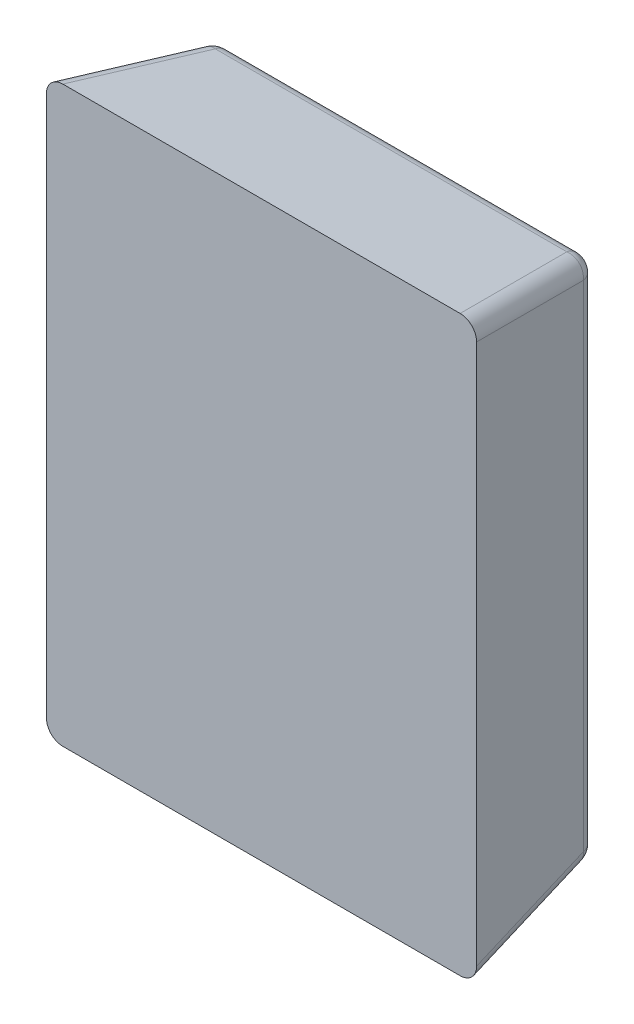
ISO-10303-21;
HEADER;
FILE_DESCRIPTION(('STEP AP214'),'2;1');
FILE_NAME('part.step','',(''),(''),'','','');
FILE_SCHEMA(('AUTOMOTIVE_DESIGN { 1 0 10303 214 1 1 1 1 }'));
ENDSEC;
DATA;
#1=APPLICATION_CONTEXT('core data for automotive mechanical design processes');
#2=APPLICATION_PROTOCOL_DEFINITION('international standard','automotive_design',2000,#1);
#3=PRODUCT_CONTEXT('',#1,'mechanical');
#4=PRODUCT('Part','Part','',(#3));
#5=PRODUCT_RELATED_PRODUCT_CATEGORY('part','',(#4));
#6=PRODUCT_DEFINITION_FORMATION('','',#4);
#7=PRODUCT_DEFINITION_CONTEXT('part definition',#1,'design');
#8=PRODUCT_DEFINITION('design','',#6,#7);
#9=PRODUCT_DEFINITION_SHAPE('','',#8);
#10=(LENGTH_UNIT() NAMED_UNIT(*) SI_UNIT(.MILLI.,.METRE.));
#11=(NAMED_UNIT(*) PLANE_ANGLE_UNIT() SI_UNIT($,.RADIAN.));
#12=(NAMED_UNIT(*) SI_UNIT($,.STERADIAN.) SOLID_ANGLE_UNIT());
#13=UNCERTAINTY_MEASURE_WITH_UNIT(LENGTH_MEASURE(1.E-05),#10,'distance_accuracy_value','');
#14=(GEOMETRIC_REPRESENTATION_CONTEXT(3) GLOBAL_UNCERTAINTY_ASSIGNED_CONTEXT((#13)) GLOBAL_UNIT_ASSIGNED_CONTEXT((#10,
#11,#12)) REPRESENTATION_CONTEXT('',''));
#15=CARTESIAN_POINT('',(0.,0.,0.));
#16=DIRECTION('',(0.,0.,1.));
#17=DIRECTION('',(1.,0.,0.));
#18=AXIS2_PLACEMENT_3D('',#15,#16,#17);
#19=CARTESIAN_POINT('',(1.12653571469062,-0.641019643054923,0.105));
#20=DIRECTION('',(0.,0.,-1.));
#21=DIRECTION('',(-1.,0.,0.));
#22=AXIS2_PLACEMENT_3D('',#19,#20,#21);
#23=PLANE('',#22);
#24=DIRECTION('',(0.,-1.,0.));
#25=VECTOR('',#24,1.);
#26=CARTESIAN_POINT('',(1.20008239842987,-0.701017157850477,0.105));
#27=LINE('',#26,#25);
#28=CARTESIAN_POINT('',(1.20008239842987,-0.744561356385283,0.105));
#29=VERTEX_POINT('',#28);
#30=CARTESIAN_POINT('',(1.20008239842987,-0.537477929724562,0.105));
#31=VERTEX_POINT('',#30);
#32=EDGE_CURVE('E236',#29,#31,#27,.F.);
#33=ORIENTED_EDGE('',*,*,#32,.F.);
#34=DIRECTION('',(-1.,0.,0.));
#35=VECTOR('',#34,1.);
#36=CARTESIAN_POINT('',(1.08153571469062,-0.744561356385283,0.105));
#37=LINE('',#36,#35);
#38=CARTESIAN_POINT('',(1.05298903095137,-0.744561356385283,0.105));
#39=VERTEX_POINT('',#38);
#40=EDGE_CURVE('E224',#39,#29,#37,.F.);
#41=ORIENTED_EDGE('',*,*,#40,.F.);
#42=DIRECTION('',(0.,1.,0.));
#43=VECTOR('',#42,1.);
#44=CARTESIAN_POINT('',(1.05298903095136,-0.581022128259368,0.105));
#45=LINE('',#44,#43);
#46=CARTESIAN_POINT('',(1.05298903095136,-0.537477929724562,0.105));
#47=VERTEX_POINT('',#46);
#48=EDGE_CURVE('E229',#47,#39,#45,.F.);
#49=ORIENTED_EDGE('',*,*,#48,.F.);
#50=DIRECTION('',(1.,0.,0.));
#51=VECTOR('',#50,1.);
#52=CARTESIAN_POINT('',(1.17153571469062,-0.537477929724562,0.105));
#53=LINE('',#52,#51);
#54=EDGE_CURVE('E241',#31,#47,#53,.F.);
#55=ORIENTED_EDGE('',*,*,#54,.F.);
#56=EDGE_LOOP('',(#33,#41,#49,#55));
#57=FACE_BOUND('',#56,.T.);
#58=ADVANCED_FACE('F17',(#57),#23,.T.);
#59=CARTESIAN_POINT('',(1.05298903095136,-0.581022128259368,0.112));
#60=DIRECTION('',(0.,1.,0.));
#61=DIRECTION('',(-1.,0.,0.));
#62=AXIS2_PLACEMENT_3D('',#59,#60,#61);
#63=CYLINDRICAL_SURFACE('',#62,0.007);
#64=DIRECTION('',(0.,1.,0.));
#65=VECTOR('',#64,1.);
#66=CARTESIAN_POINT('',(1.04609537668028,-0.521024613463813,0.110784462756332));
#67=LINE('',#66,#65);
#68=CARTESIAN_POINT('',(1.04609537668028,-0.537477929724562,0.110784462756332));
#69=VERTEX_POINT('',#68);
#70=CARTESIAN_POINT('',(1.04609537668028,-0.744561356385283,0.110784462756331));
#71=VERTEX_POINT('',#70);
#72=EDGE_CURVE('E114',#69,#71,#67,.F.);
#73=ORIENTED_EDGE('',*,*,#72,.F.);
#74=CARTESIAN_POINT('',(1.05298903095137,-0.537477929724562,0.112));
#75=DIRECTION('',(0.,1.,0.));
#76=DIRECTION('',(1.,0.,0.));
#77=AXIS2_PLACEMENT_3D('',#74,#75,#76);
#78=CIRCLE('',#77,0.007);
#79=EDGE_CURVE('E221',#47,#69,#78,.T.);
#80=ORIENTED_EDGE('',*,*,#79,.F.);
#81=ORIENTED_EDGE('',*,*,#48,.T.);
#82=CARTESIAN_POINT('',(1.05298903095137,-0.744561356385283,0.112));
#83=DIRECTION('',(0.,1.,0.));
#84=DIRECTION('',(1.,0.,0.));
#85=AXIS2_PLACEMENT_3D('',#82,#83,#84);
#86=CIRCLE('',#85,0.007);
#87=EDGE_CURVE('E74',#71,#39,#86,.F.);
#88=ORIENTED_EDGE('',*,*,#87,.F.);
#89=EDGE_LOOP('',(#73,#80,#81,#88));
#90=FACE_BOUND('',#89,.T.);
#91=ADVANCED_FACE('F214',(#90),#63,.T.);
#92=CARTESIAN_POINT('',(1.05298903095137,-0.537477929724562,0.112));
#93=DIRECTION('',(1.,0.,0.));
#94=DIRECTION('',(0.,1.,0.));
#95=AXIS2_PLACEMENT_3D('',#92,#93,#94);
#96=SPHERICAL_SURFACE('',#95,0.007);
#97=ORIENTED_EDGE('',*,*,#79,.T.);
#98=CARTESIAN_POINT('',(1.05298903095137,-0.537477929724562,0.111999999999999));
#99=DIRECTION('',(-0.17108786974604,0.171087869746041,0.970287525247812));
#100=DIRECTION('',(0.,-0.984807753012207,0.173648177666936));
#101=AXIS2_PLACEMENT_3D('',#98,#99,#100);
#102=CIRCLE('',#101,0.007);
#103=CARTESIAN_POINT('',(1.05298903095136,-0.530584275453477,0.11078446275633));
#104=VERTEX_POINT('',#103);
#105=EDGE_CURVE('E20',#104,#69,#102,.T.);
#106=ORIENTED_EDGE('',*,*,#105,.F.);
#107=CARTESIAN_POINT('',(1.05298903095136,-0.537477929724562,0.112));
#108=DIRECTION('',(1.,0.,0.));
#109=DIRECTION('',(0.,1.,0.));
#110=AXIS2_PLACEMENT_3D('',#107,#108,#109);
#111=CIRCLE('',#110,0.007);
#112=EDGE_CURVE('E223',#47,#104,#111,.T.);
#113=ORIENTED_EDGE('',*,*,#112,.F.);
#114=EDGE_LOOP('',(#97,#106,#113));
#115=FACE_BOUND('',#114,.T.);
#116=ADVANCED_FACE('F210',(#115),#96,.T.);
#117=CARTESIAN_POINT('',(1.17153571469062,-0.537477929724562,0.112));
#118=DIRECTION('',(1.,0.,0.));
#119=DIRECTION('',(0.,1.,0.));
#120=AXIS2_PLACEMENT_3D('',#117,#118,#119);
#121=CYLINDRICAL_SURFACE('',#120,0.007);
#122=DIRECTION('',(1.,0.,0.));
#123=VECTOR('',#122,1.);
#124=CARTESIAN_POINT('',(1.21653571469062,-0.530584275453476,0.110784462756331));
#125=LINE('',#124,#123);
#126=CARTESIAN_POINT('',(1.20008239842987,-0.530584275453476,0.110784462756331));
#127=VERTEX_POINT('',#126);
#128=EDGE_CURVE('E146',#127,#104,#125,.F.);
#129=ORIENTED_EDGE('',*,*,#128,.F.);
#130=CARTESIAN_POINT('',(1.20008239842987,-0.537477929724562,0.112));
#131=DIRECTION('',(1.,0.,0.));
#132=DIRECTION('',(0.,1.,0.));
#133=AXIS2_PLACEMENT_3D('',#130,#131,#132);
#134=CIRCLE('',#133,0.00699999999999995);
#135=EDGE_CURVE('E198',#31,#127,#134,.T.);
#136=ORIENTED_EDGE('',*,*,#135,.F.);
#137=ORIENTED_EDGE('',*,*,#54,.T.);
#138=ORIENTED_EDGE('',*,*,#112,.T.);
#139=EDGE_LOOP('',(#129,#136,#137,#138));
#140=FACE_BOUND('',#139,.T.);
#141=ADVANCED_FACE('F206',(#140),#121,.T.);
#142=CARTESIAN_POINT('',(1.20008239842987,-0.537477929724562,0.112));
#143=DIRECTION('',(1.,0.,0.));
#144=DIRECTION('',(0.,1.,0.));
#145=AXIS2_PLACEMENT_3D('',#142,#143,#144);
#146=SPHERICAL_SURFACE('',#145,0.007);
#147=ORIENTED_EDGE('',*,*,#135,.T.);
#148=CARTESIAN_POINT('',(1.20008239842987,-0.537477929724562,0.111999999999999));
#149=DIRECTION('',(0.171087869746028,0.171087869746031,0.970287525247816));
#150=DIRECTION('',(0.,-0.984807753012209,0.173648177666926));
#151=AXIS2_PLACEMENT_3D('',#148,#149,#150);
#152=CIRCLE('',#151,0.007);
#153=CARTESIAN_POINT('',(1.20697605270095,-0.537477929724562,0.11078446275633));
#154=VERTEX_POINT('',#153);
#155=EDGE_CURVE('E136',#154,#127,#152,.T.);
#156=ORIENTED_EDGE('',*,*,#155,.F.);
#157=CARTESIAN_POINT('',(1.20008239842987,-0.537477929724562,0.112));
#158=DIRECTION('',(0.,-1.,0.));
#159=DIRECTION('',(1.,0.,0.));
#160=AXIS2_PLACEMENT_3D('',#157,#158,#159);
#161=CIRCLE('',#160,0.007);
#162=EDGE_CURVE('E194',#31,#154,#161,.T.);
#163=ORIENTED_EDGE('',*,*,#162,.F.);
#164=EDGE_LOOP('',(#147,#156,#163));
#165=FACE_BOUND('',#164,.T.);
#166=ADVANCED_FACE('F203',(#165),#146,.T.);
#167=CARTESIAN_POINT('',(1.20008239842987,-0.701017157850477,0.112));
#168=DIRECTION('',(0.,-1.,0.));
#169=DIRECTION('',(1.,0.,0.));
#170=AXIS2_PLACEMENT_3D('',#167,#168,#169);
#171=CYLINDRICAL_SURFACE('',#170,0.007);
#172=DIRECTION('',(0.,1.,0.));
#173=VECTOR('',#172,1.);
#174=CARTESIAN_POINT('',(1.20697605270096,-0.761014672646032,0.11078446275633));
#175=LINE('',#174,#173);
#176=CARTESIAN_POINT('',(1.20697605270096,-0.744561356385283,0.11078446275633));
#177=VERTEX_POINT('',#176);
#178=EDGE_CURVE('E137',#177,#154,#175,.T.);
#179=ORIENTED_EDGE('',*,*,#178,.F.);
#180=CARTESIAN_POINT('',(1.20008239842987,-0.744561356385283,0.112));
#181=DIRECTION('',(0.,1.,0.));
#182=DIRECTION('',(1.,0.,0.));
#183=AXIS2_PLACEMENT_3D('',#180,#181,#182);
#184=CIRCLE('',#183,0.007);
#185=EDGE_CURVE('E190',#29,#177,#184,.F.);
#186=ORIENTED_EDGE('',*,*,#185,.F.);
#187=ORIENTED_EDGE('',*,*,#32,.T.);
#188=ORIENTED_EDGE('',*,*,#162,.T.);
#189=EDGE_LOOP('',(#179,#186,#187,#188));
#190=FACE_BOUND('',#189,.T.);
#191=ADVANCED_FACE('F182',(#190),#171,.T.);
#192=CARTESIAN_POINT('',(1.20008239842987,-0.744561356385283,0.112));
#193=DIRECTION('',(1.,0.,0.));
#194=DIRECTION('',(0.,1.,0.));
#195=AXIS2_PLACEMENT_3D('',#192,#193,#194);
#196=SPHERICAL_SURFACE('',#195,0.007);
#197=CARTESIAN_POINT('',(1.20008239842987,-0.744561356385283,0.112));
#198=DIRECTION('',(-1.,0.,0.));
#199=DIRECTION('',(0.,-1.,0.));
#200=AXIS2_PLACEMENT_3D('',#197,#198,#199);
#201=CIRCLE('',#200,0.007);
#202=CARTESIAN_POINT('',(1.20008239842987,-0.751455010656368,0.110784462756331));
#203=VERTEX_POINT('',#202);
#204=EDGE_CURVE('E193',#29,#203,#201,.T.);
#205=ORIENTED_EDGE('',*,*,#204,.F.);
#206=ORIENTED_EDGE('',*,*,#185,.T.);
#207=CARTESIAN_POINT('',(1.20008239842987,-0.744561356385283,0.111999999999999));
#208=DIRECTION('',(0.171087869746032,-0.171087869746034,0.970287525247815));
#209=DIRECTION('',(0.,-0.984807753012208,-0.173648177666929));
#210=AXIS2_PLACEMENT_3D('',#207,#208,#209);
#211=CIRCLE('',#210,0.007);
#212=EDGE_CURVE('E133',#203,#177,#211,.T.);
#213=ORIENTED_EDGE('',*,*,#212,.F.);
#214=EDGE_LOOP('',(#205,#206,#213));
#215=FACE_BOUND('',#214,.T.);
#216=ADVANCED_FACE('F178',(#215),#196,.T.);
#217=CARTESIAN_POINT('',(1.08153571469062,-0.744561356385283,0.112));
#218=DIRECTION('',(-1.,0.,0.));
#219=DIRECTION('',(0.,-1.,0.));
#220=AXIS2_PLACEMENT_3D('',#217,#218,#219);
#221=CYLINDRICAL_SURFACE('',#220,0.007);
#222=DIRECTION('',(1.,0.,0.));
#223=VECTOR('',#222,1.);
#224=CARTESIAN_POINT('',(1.03653571469062,-0.751455010656368,0.110784462756331));
#225=LINE('',#224,#223);
#226=CARTESIAN_POINT('',(1.05298903095137,-0.751455010656369,0.110784462756332));
#227=VERTEX_POINT('',#226);
#228=EDGE_CURVE('E134',#227,#203,#225,.T.);
#229=ORIENTED_EDGE('',*,*,#228,.F.);
#230=CARTESIAN_POINT('',(1.05298903095137,-0.744561356385283,0.112));
#231=DIRECTION('',(1.,0.,0.));
#232=DIRECTION('',(0.,1.,0.));
#233=AXIS2_PLACEMENT_3D('',#230,#231,#232);
#234=CIRCLE('',#233,0.00699999999999995);
#235=EDGE_CURVE('E82',#39,#227,#234,.F.);
#236=ORIENTED_EDGE('',*,*,#235,.F.);
#237=ORIENTED_EDGE('',*,*,#40,.T.);
#238=ORIENTED_EDGE('',*,*,#204,.T.);
#239=EDGE_LOOP('',(#229,#236,#237,#238));
#240=FACE_BOUND('',#239,.T.);
#241=ADVANCED_FACE('F173',(#240),#221,.T.);
#242=CARTESIAN_POINT('',(1.05298903095137,-0.744561356385283,0.112));
#243=DIRECTION('',(1.,0.,0.));
#244=DIRECTION('',(0.,1.,0.));
#245=AXIS2_PLACEMENT_3D('',#242,#243,#244);
#246=SPHERICAL_SURFACE('',#245,0.007);
#247=ORIENTED_EDGE('',*,*,#87,.T.);
#248=ORIENTED_EDGE('',*,*,#235,.T.);
#249=CARTESIAN_POINT('',(1.05298903095136,-0.744561356385283,0.112));
#250=DIRECTION('',(-0.171087869746039,-0.171087869746042,0.970287525247812));
#251=DIRECTION('',(0.,-0.984807753012207,-0.173648177666937));
#252=AXIS2_PLACEMENT_3D('',#249,#250,#251);
#253=CIRCLE('',#252,0.007);
#254=EDGE_CURVE('E126',#71,#227,#253,.T.);
#255=ORIENTED_EDGE('',*,*,#254,.F.);
#256=EDGE_LOOP('',(#247,#248,#255));
#257=FACE_BOUND('',#256,.T.);
#258=ADVANCED_FACE('F169',(#257),#246,.T.);
#259=CARTESIAN_POINT('',(1.03653571469062,-0.521024613463813,0.165));
#260=DIRECTION('',(-0.984807753012208,0.,-0.173648177666929));
#261=DIRECTION('',(-0.173648177666929,0.,0.984807753012208));
#262=AXIS2_PLACEMENT_3D('',#259,#260,#261);
#263=PLANE('',#262);
#264=DIRECTION('',(-0.17108786974604,0.171087869746041,0.970287525247812));
#265=VECTOR('',#264,1.);
#266=CARTESIAN_POINT('',(1.0389683254542,-0.530350878498484,0.15120397880227));
#267=LINE('',#266,#265);
#268=CARTESIAN_POINT('',(1.03653571469062,-0.527918267734898,0.165));
#269=VERTEX_POINT('',#268);
#270=EDGE_CURVE('E104',#69,#269,#267,.T.);
#271=ORIENTED_EDGE('',*,*,#270,.F.);
#272=ORIENTED_EDGE('',*,*,#72,.T.);
#273=DIRECTION('',(-0.171087869746034,-0.171087869746047,0.970287525247812));
#274=VECTOR('',#273,1.);
#275=CARTESIAN_POINT('',(1.04609537668028,-0.744561356385283,0.110784462756332));
#276=LINE('',#275,#274);
#277=CARTESIAN_POINT('',(1.03653571469062,-0.754121018374947,0.165));
#278=VERTEX_POINT('',#277);
#279=EDGE_CURVE('E111',#71,#278,#276,.T.);
#280=ORIENTED_EDGE('',*,*,#279,.T.);
#281=DIRECTION('',(0.,1.,0.));
#282=VECTOR('',#281,1.);
#283=CARTESIAN_POINT('',(1.03653571469062,-0.641019643054923,0.165));
#284=LINE('',#283,#282);
#285=EDGE_CURVE('E113',#278,#269,#284,.T.);
#286=ORIENTED_EDGE('',*,*,#285,.T.);
#287=EDGE_LOOP('',(#271,#272,#280,#286));
#288=FACE_BOUND('',#287,.T.);
#289=ADVANCED_FACE('F112',(#288),#263,.T.);
#290=CARTESIAN_POINT('',(1.04586197972529,-0.530350878498484,0.152419516045939));
#291=DIRECTION('',(-0.17108786974604,0.171087869746041,0.970287525247812));
#292=DIRECTION('',(0.,-0.984807753012207,0.173648177666936));
#293=AXIS2_PLACEMENT_3D('',#290,#291,#292);
#294=CYLINDRICAL_SURFACE('',#293,0.007);
#295=DIRECTION('',(-0.171087869746152,0.171087869746032,0.970287525247794));
#296=VECTOR('',#295,1.);
#297=CARTESIAN_POINT('',(1.05298903095137,-0.530584275453477,0.110784462756331));
#298=LINE('',#297,#296);
#299=CARTESIAN_POINT('',(1.0434293689617,-0.521024613463813,0.165));
#300=VERTEX_POINT('',#299);
#301=EDGE_CURVE('E151',#104,#300,#298,.T.);
#302=ORIENTED_EDGE('',*,*,#301,.F.);
#303=ORIENTED_EDGE('',*,*,#105,.T.);
#304=ORIENTED_EDGE('',*,*,#270,.T.);
#305=CARTESIAN_POINT('',(1.04364370097382,-0.528132599747013,0.165));
#306=DIRECTION('',(0.,0.,-1.));
#307=DIRECTION('',(-0.707106781186545,0.707106781186551,0.));
#308=AXIS2_PLACEMENT_3D('',#305,#306,#307);
#309=ELLIPSE('',#308,0.00721435638184897,0.007);
#310=EDGE_CURVE('E120',#269,#300,#309,.T.);
#311=ORIENTED_EDGE('',*,*,#310,.T.);
#312=EDGE_LOOP('',(#302,#303,#304,#311));
#313=FACE_BOUND('',#312,.T.);
#314=ADVANCED_FACE('F279',(#313),#294,.T.);
#315=CARTESIAN_POINT('',(1.21653571469062,-0.521024613463813,0.165));
#316=DIRECTION('',(0.,0.984807753012208,-0.17364817766693));
#317=DIRECTION('',(0.,0.17364817766693,0.984807753012208));
#318=AXIS2_PLACEMENT_3D('',#315,#316,#317);
#319=PLANE('',#318);
#320=DIRECTION('',(0.171087869746028,0.171087869746031,0.970287525247816));
#321=VECTOR('',#320,1.);
#322=CARTESIAN_POINT('',(1.20633146336985,-0.524335210513493,0.14622467114007));
#323=LINE('',#322,#321);
#324=CARTESIAN_POINT('',(1.20964206041953,-0.521024613463813,0.165));
#325=VERTEX_POINT('',#324);
#326=EDGE_CURVE('E138',#127,#325,#323,.T.);
#327=ORIENTED_EDGE('',*,*,#326,.F.);
#328=ORIENTED_EDGE('',*,*,#128,.T.);
#329=ORIENTED_EDGE('',*,*,#301,.T.);
#330=DIRECTION('',(-1.,0.,0.));
#331=VECTOR('',#330,1.);
#332=CARTESIAN_POINT('',(1.12653571469062,-0.521024613463813,0.165));
#333=LINE('',#332,#331);
#334=EDGE_CURVE('E156',#300,#325,#333,.F.);
#335=ORIENTED_EDGE('',*,*,#334,.T.);
#336=EDGE_LOOP('',(#327,#328,#329,#335));
#337=FACE_BOUND('',#336,.T.);
#338=ADVANCED_FACE('F271',(#337),#319,.T.);
#339=CARTESIAN_POINT('',(1.20633146336985,-0.531228864784578,0.147440208383739));
#340=DIRECTION('',(0.171087869746028,0.171087869746031,0.970287525247816));
#341=DIRECTION('',(0.,-0.984807753012209,0.173648177666926));
#342=AXIS2_PLACEMENT_3D('',#339,#340,#341);
#343=CYLINDRICAL_SURFACE('',#342,0.007);
#344=DIRECTION('',(0.171087869746032,0.17108786974604,0.970287525247814));
#345=VECTOR('',#344,1.);
#346=CARTESIAN_POINT('',(1.20697605270096,-0.537477929724562,0.11078446275633));
#347=LINE('',#346,#345);
#348=CARTESIAN_POINT('',(1.21653571469062,-0.527918267734898,0.165));
#349=VERTEX_POINT('',#348);
#350=EDGE_CURVE('E144',#154,#349,#347,.T.);
#351=ORIENTED_EDGE('',*,*,#350,.F.);
#352=ORIENTED_EDGE('',*,*,#155,.T.);
#353=ORIENTED_EDGE('',*,*,#326,.T.);
#354=CARTESIAN_POINT('',(1.20942772840742,-0.528132599747013,0.165));
#355=DIRECTION('',(0.,0.,-1.));
#356=DIRECTION('',(0.707106781186542,0.707106781186553,0.));
#357=AXIS2_PLACEMENT_3D('',#354,#355,#356);
#358=ELLIPSE('',#357,0.00721435638184894,0.007);
#359=EDGE_CURVE('E159',#325,#349,#358,.T.);
#360=ORIENTED_EDGE('',*,*,#359,.T.);
#361=EDGE_LOOP('',(#351,#352,#353,#360));
#362=FACE_BOUND('',#361,.T.);
#363=ADVANCED_FACE('F269',(#362),#343,.T.);
#364=CARTESIAN_POINT('',(1.21653571469062,-0.761014672646032,0.165));
#365=DIRECTION('',(0.984807753012208,0.,-0.173648177666928));
#366=DIRECTION('',(-0.173648177666928,0.,-0.984807753012208));
#367=AXIS2_PLACEMENT_3D('',#364,#365,#366);
#368=PLANE('',#367);
#369=ORIENTED_EDGE('',*,*,#350,.T.);
#370=DIRECTION('',(0.,1.,0.));
#371=VECTOR('',#370,1.);
#372=CARTESIAN_POINT('',(1.21653571469062,-0.641019643054923,0.165));
#373=LINE('',#372,#371);
#374=CARTESIAN_POINT('',(1.21653571469062,-0.754121018374947,0.165));
#375=VERTEX_POINT('',#374);
#376=EDGE_CURVE('E248',#349,#375,#373,.F.);
#377=ORIENTED_EDGE('',*,*,#376,.T.);
#378=DIRECTION('',(0.171087869746032,-0.171087869746034,0.970287525247815));
#379=VECTOR('',#378,1.);
#380=CARTESIAN_POINT('',(1.21410310392704,-0.751688407611361,0.151203978802271));
#381=LINE('',#380,#379);
#382=EDGE_CURVE('E135',#177,#375,#381,.T.);
#383=ORIENTED_EDGE('',*,*,#382,.F.);
#384=ORIENTED_EDGE('',*,*,#178,.T.);
#385=EDGE_LOOP('',(#369,#377,#383,#384));
#386=FACE_BOUND('',#385,.T.);
#387=ADVANCED_FACE('F264',(#386),#368,.T.);
#388=CARTESIAN_POINT('',(1.20720944965595,-0.751688407611361,0.152419516045939));
#389=DIRECTION('',(0.171087869746032,-0.171087869746034,0.970287525247815));
#390=DIRECTION('',(0.,-0.984807753012208,-0.173648177666929));
#391=AXIS2_PLACEMENT_3D('',#388,#389,#390);
#392=CYLINDRICAL_SURFACE('',#391,0.007);
#393=DIRECTION('',(0.171087869745972,-0.171087869746038,0.970287525247825));
#394=VECTOR('',#393,1.);
#395=CARTESIAN_POINT('',(1.20008239842987,-0.751455010656368,0.110784462756331));
#396=LINE('',#395,#394);
#397=CARTESIAN_POINT('',(1.20964206041953,-0.761014672646032,0.165));
#398=VERTEX_POINT('',#397);
#399=EDGE_CURVE('E132',#203,#398,#396,.T.);
#400=ORIENTED_EDGE('',*,*,#399,.F.);
#401=ORIENTED_EDGE('',*,*,#212,.T.);
#402=ORIENTED_EDGE('',*,*,#382,.T.);
#403=CARTESIAN_POINT('',(1.20942772840742,-0.753906686362832,0.165));
#404=DIRECTION('',(0.,0.,-1.));
#405=DIRECTION('',(0.707106781186544,-0.707106781186551,0.));
#406=AXIS2_PLACEMENT_3D('',#403,#404,#405);
#407=ELLIPSE('',#406,0.00721435638184896,0.007);
#408=EDGE_CURVE('E26',#375,#398,#407,.T.);
#409=ORIENTED_EDGE('',*,*,#408,.T.);
#410=EDGE_LOOP('',(#400,#401,#402,#409));
#411=FACE_BOUND('',#410,.T.);
#412=ADVANCED_FACE('F263',(#411),#392,.T.);
#413=CARTESIAN_POINT('',(1.03653571469062,-0.761014672646032,0.165));
#414=DIRECTION('',(0.,-0.984807753012208,-0.173648177666931));
#415=DIRECTION('',(0.,0.173648177666931,-0.984807753012208));
#416=AXIS2_PLACEMENT_3D('',#413,#414,#415);
#417=PLANE('',#416);
#418=ORIENTED_EDGE('',*,*,#399,.T.);
#419=DIRECTION('',(-1.,0.,0.));
#420=VECTOR('',#419,1.);
#421=CARTESIAN_POINT('',(1.12653571469062,-0.761014672646032,0.165));
#422=LINE('',#421,#420);
#423=CARTESIAN_POINT('',(1.0434293689617,-0.761014672646032,0.165));
#424=VERTEX_POINT('',#423);
#425=EDGE_CURVE('E11',#398,#424,#422,.T.);
#426=ORIENTED_EDGE('',*,*,#425,.T.);
#427=DIRECTION('',(-0.17108786974604,-0.171087869746037,0.970287525247813));
#428=VECTOR('',#427,1.);
#429=CARTESIAN_POINT('',(1.05298903095136,-0.751455010656368,0.11078446275633));
#430=LINE('',#429,#428);
#431=EDGE_CURVE('E124',#227,#424,#430,.T.);
#432=ORIENTED_EDGE('',*,*,#431,.F.);
#433=ORIENTED_EDGE('',*,*,#228,.T.);
#434=EDGE_LOOP('',(#418,#426,#432,#433));
#435=FACE_BOUND('',#434,.T.);
#436=ADVANCED_FACE('F259',(#435),#417,.T.);
#437=CARTESIAN_POINT('',(1.04673996601138,-0.750810421325267,0.147440208383738));
#438=DIRECTION('',(-0.171087869746039,-0.171087869746042,0.970287525247812));
#439=DIRECTION('',(0.,-0.984807753012207,-0.173648177666937));
#440=AXIS2_PLACEMENT_3D('',#437,#438,#439);
#441=CYLINDRICAL_SURFACE('',#440,0.007);
#442=ORIENTED_EDGE('',*,*,#431,.T.);
#443=CARTESIAN_POINT('',(1.04364370097381,-0.753906686362832,0.165));
#444=DIRECTION('',(0.,0.,-1.));
#445=DIRECTION('',(-0.70710678118654,-0.707106781186555,0.));
#446=AXIS2_PLACEMENT_3D('',#443,#444,#445);
#447=ELLIPSE('',#446,0.00721435638184897,0.007);
#448=EDGE_CURVE('E35',#424,#278,#447,.T.);
#449=ORIENTED_EDGE('',*,*,#448,.T.);
#450=ORIENTED_EDGE('',*,*,#279,.F.);
#451=ORIENTED_EDGE('',*,*,#254,.T.);
#452=EDGE_LOOP('',(#442,#449,#450,#451));
#453=FACE_BOUND('',#452,.T.);
#454=ADVANCED_FACE('F122',(#453),#441,.T.);
#455=CARTESIAN_POINT('',(1.12653571469062,-0.641019643054923,0.165));
#456=DIRECTION('',(0.,0.,-1.));
#457=DIRECTION('',(-1.,0.,0.));
#458=AXIS2_PLACEMENT_3D('',#455,#456,#457);
#459=PLANE('',#458);
#460=ORIENTED_EDGE('',*,*,#425,.F.);
#461=ORIENTED_EDGE('',*,*,#408,.F.);
#462=ORIENTED_EDGE('',*,*,#376,.F.);
#463=ORIENTED_EDGE('',*,*,#359,.F.);
#464=ORIENTED_EDGE('',*,*,#334,.F.);
#465=ORIENTED_EDGE('',*,*,#310,.F.);
#466=ORIENTED_EDGE('',*,*,#285,.F.);
#467=ORIENTED_EDGE('',*,*,#448,.F.);
#468=EDGE_LOOP('',(#460,#461,#462,#463,#464,#465,#466,#467));
#469=FACE_BOUND('',#468,.T.);
#470=ADVANCED_FACE('F118',(#469),#459,.F.);
#471=CLOSED_SHELL('',(#58,#91,#116,#141,#166,#191,#216,#241,#258,#289,#314,#338,#363,#387,#412,
#436,#454,#470));
#472=MANIFOLD_SOLID_BREP('B1',#471);
#473=ADVANCED_BREP_SHAPE_REPRESENTATION('',(#18,#472),#14);
#474=SHAPE_DEFINITION_REPRESENTATION(#9,#473);
ENDSEC;
END-ISO-10303-21;
